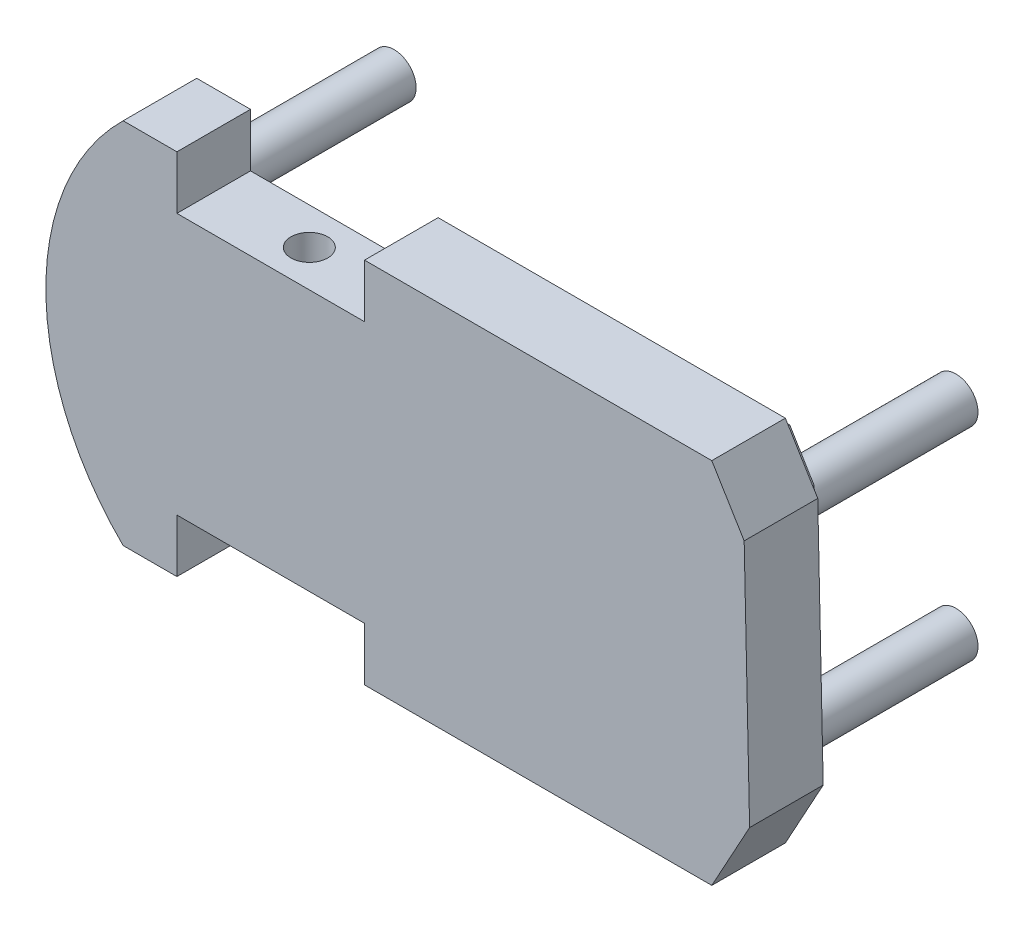
ISO-10303-21;
HEADER;
FILE_DESCRIPTION(('STEP AP214'),'2;1');
FILE_NAME('part.step','',(''),(''),'','','');
FILE_SCHEMA(('AUTOMOTIVE_DESIGN { 1 0 10303 214 1 1 1 1 }'));
ENDSEC;
DATA;
#1=APPLICATION_CONTEXT('core data for automotive mechanical design processes');
#2=APPLICATION_PROTOCOL_DEFINITION('international standard','automotive_design',2000,#1);
#3=PRODUCT_CONTEXT('',#1,'mechanical');
#4=PRODUCT('Part','Part','',(#3));
#5=PRODUCT_RELATED_PRODUCT_CATEGORY('part','',(#4));
#6=PRODUCT_DEFINITION_FORMATION('','',#4);
#7=PRODUCT_DEFINITION_CONTEXT('part definition',#1,'design');
#8=PRODUCT_DEFINITION('design','',#6,#7);
#9=PRODUCT_DEFINITION_SHAPE('','',#8);
#10=(LENGTH_UNIT() NAMED_UNIT(*) SI_UNIT(.MILLI.,.METRE.));
#11=(NAMED_UNIT(*) PLANE_ANGLE_UNIT() SI_UNIT($,.RADIAN.));
#12=(NAMED_UNIT(*) SI_UNIT($,.STERADIAN.) SOLID_ANGLE_UNIT());
#13=UNCERTAINTY_MEASURE_WITH_UNIT(LENGTH_MEASURE(1.E-05),#10,'distance_accuracy_value','');
#14=(GEOMETRIC_REPRESENTATION_CONTEXT(3) GLOBAL_UNCERTAINTY_ASSIGNED_CONTEXT((#13)) GLOBAL_UNIT_ASSIGNED_CONTEXT((#10,
#11,#12)) REPRESENTATION_CONTEXT('',''));
#15=CARTESIAN_POINT('',(0.,0.,0.));
#16=DIRECTION('',(0.,0.,1.));
#17=DIRECTION('',(1.,0.,0.));
#18=AXIS2_PLACEMENT_3D('',#15,#16,#17);
#19=CARTESIAN_POINT('',(0.,0.,0.));
#20=DIRECTION('',(0.,0.,1.));
#21=DIRECTION('',(1.,0.,0.));
#22=AXIS2_PLACEMENT_3D('',#19,#20,#21);
#23=PLANE('',#22);
#24=DIRECTION('',(-1.,0.,0.));
#25=VECTOR('',#24,1.);
#26=CARTESIAN_POINT('',(-1221.0953514439,1.42875124120427,0.));
#27=LINE('',#26,#25);
#28=CARTESIAN_POINT('',(-1170.0953514439,1.42875124120427,0.));
#29=VERTEX_POINT('',#28);
#30=CARTESIAN_POINT('',(-1221.0953514439,1.42875124120427,0.));
#31=VERTEX_POINT('',#30);
#32=EDGE_CURVE('E284',#29,#31,#27,.T.);
#33=ORIENTED_EDGE('',*,*,#32,.T.);
#34=DIRECTION('',(0.,-1.,0.));
#35=VECTOR('',#34,1.);
#36=CARTESIAN_POINT('',(-1221.0953514439,-13.5712487587957,0.));
#37=LINE('',#36,#35);
#38=CARTESIAN_POINT('',(-1221.0953514439,-13.0712487587957,0.));
#39=VERTEX_POINT('',#38);
#40=EDGE_CURVE('E281',#31,#39,#37,.T.);
#41=ORIENTED_EDGE('',*,*,#40,.T.);
#42=DIRECTION('',(1.,0.,0.));
#43=VECTOR('',#42,1.);
#44=CARTESIAN_POINT('',(0.,-13.0712487587957,0.));
#45=LINE('',#44,#43);
#46=CARTESIAN_POINT('',(-1235.70737283867,-13.0712487587957,0.));
#47=VERTEX_POINT('',#46);
#48=EDGE_CURVE('E346',#47,#39,#45,.T.);
#49=ORIENTED_EDGE('',*,*,#48,.F.);
#50=CARTESIAN_POINT('',(-1186.717577983,36.9287512412043,0.));
#51=DIRECTION('',(0.,0.,1.));
#52=DIRECTION('',(1.,0.,0.));
#53=AXIS2_PLACEMENT_3D('',#50,#51,#52);
#54=CIRCLE('',#53,69.9999999999998);
#55=CARTESIAN_POINT('',(-1235.70737283867,86.9287512412043,0.));
#56=VERTEX_POINT('',#55);
#57=EDGE_CURVE('E362',#56,#47,#54,.T.);
#58=ORIENTED_EDGE('',*,*,#57,.F.);
#59=DIRECTION('',(1.,0.,0.));
#60=VECTOR('',#59,1.);
#61=CARTESIAN_POINT('',(0.,86.9287512412044,0.));
#62=LINE('',#61,#60);
#63=CARTESIAN_POINT('',(-1221.0953514439,86.9287512412043,0.));
#64=VERTEX_POINT('',#63);
#65=EDGE_CURVE('E359',#56,#64,#62,.T.);
#66=ORIENTED_EDGE('',*,*,#65,.T.);
#67=DIRECTION('',(0.,-1.,0.));
#68=VECTOR('',#67,1.);
#69=CARTESIAN_POINT('',(-1221.0953514439,0.,0.));
#70=LINE('',#69,#68);
#71=CARTESIAN_POINT('',(-1221.0953514439,72.4287512412043,0.));
#72=VERTEX_POINT('',#71);
#73=EDGE_CURVE('E50',#64,#72,#70,.T.);
#74=ORIENTED_EDGE('',*,*,#73,.T.);
#75=DIRECTION('',(1.,0.,0.));
#76=VECTOR('',#75,1.);
#77=CARTESIAN_POINT('',(-1221.0953514439,72.4287512412043,0.));
#78=LINE('',#77,#76);
#79=CARTESIAN_POINT('',(-1170.0953514439,72.4287512412043,0.));
#80=VERTEX_POINT('',#79);
#81=EDGE_CURVE('E280',#72,#80,#78,.T.);
#82=ORIENTED_EDGE('',*,*,#81,.T.);
#83=DIRECTION('',(0.,1.,0.));
#84=VECTOR('',#83,1.);
#85=CARTESIAN_POINT('',(-1170.0953514439,87.4287512412043,0.));
#86=LINE('',#85,#84);
#87=CARTESIAN_POINT('',(-1170.0953514439,86.9287512412043,0.));
#88=VERTEX_POINT('',#87);
#89=EDGE_CURVE('E295',#80,#88,#86,.T.);
#90=ORIENTED_EDGE('',*,*,#89,.T.);
#91=CARTESIAN_POINT('',(-1075.70737283867,86.9287512412043,0.));
#92=VERTEX_POINT('',#91);
#93=EDGE_CURVE('E358',#88,#92,#62,.T.);
#94=ORIENTED_EDGE('',*,*,#93,.T.);
#95=DIRECTION('',(0.519081832393097,-0.854724547020515,0.));
#96=VECTOR('',#95,1.);
#97=CARTESIAN_POINT('',(-747.294527683499,-453.838624524696,0.));
#98=LINE('',#97,#96);
#99=CARTESIAN_POINT('',(-1066.90354903965,72.4323003175205,0.));
#100=VERTEX_POINT('',#99);
#101=EDGE_CURVE('E355',#92,#100,#98,.T.);
#102=ORIENTED_EDGE('',*,*,#101,.T.);
#103=DIRECTION('',(0.0221757799851452,-0.999754087154462,0.));
#104=VECTOR('',#103,1.);
#105=CARTESIAN_POINT('',(-1064.77303522339,-23.6179805280267,0.));
#106=LINE('',#105,#104);
#107=CARTESIAN_POINT('',(-1065.42313354024,5.69050150754845,0.));
#108=VERTEX_POINT('',#107);
#109=EDGE_CURVE('E352',#100,#108,#106,.T.);
#110=ORIENTED_EDGE('',*,*,#109,.T.);
#111=DIRECTION('',(-0.480672254761375,-0.87690032700565,0.));
#112=VECTOR('',#111,1.);
#113=CARTESIAN_POINT('',(-821.660131553006,450.392383168271,0.));
#114=LINE('',#113,#112);
#115=CARTESIAN_POINT('',(-1075.70737283867,-13.0712487587957,0.));
#116=VERTEX_POINT('',#115);
#117=EDGE_CURVE('E349',#108,#116,#114,.T.);
#118=ORIENTED_EDGE('',*,*,#117,.T.);
#119=CARTESIAN_POINT('',(-1170.0953514439,-13.0712487587957,0.));
#120=VERTEX_POINT('',#119);
#121=EDGE_CURVE('E325',#120,#116,#45,.T.);
#122=ORIENTED_EDGE('',*,*,#121,.F.);
#123=DIRECTION('',(0.,1.,0.));
#124=VECTOR('',#123,1.);
#125=CARTESIAN_POINT('',(-1170.0953514439,0.,0.));
#126=LINE('',#125,#124);
#127=EDGE_CURVE('E11',#120,#29,#126,.T.);
#128=ORIENTED_EDGE('',*,*,#127,.T.);
#129=EDGE_LOOP('',(#33,#41,#49,#58,#66,#74,#82,#90,#94,#102,#110,#118,#122,#128));
#130=FACE_BOUND('',#129,.T.);
#131=DIRECTION('',(0.,1.,0.));
#132=VECTOR('',#131,1.);
#133=CARTESIAN_POINT('',(-1165.0953514439,-8.07124875879573,0.));
#134=LINE('',#133,#132);
#135=CARTESIAN_POINT('',(-1165.0953514439,-8.07124875879573,0.));
#136=VERTEX_POINT('',#135);
#137=CARTESIAN_POINT('',(-1165.0953514439,6.42875124120427,0.));
#138=VERTEX_POINT('',#137);
#139=EDGE_CURVE('E248',#136,#138,#134,.T.);
#140=ORIENTED_EDGE('',*,*,#139,.F.);
#141=DIRECTION('',(-1.,0.,0.));
#142=VECTOR('',#141,1.);
#143=CARTESIAN_POINT('',(-1078.66852890878,-8.07124875879573,0.));
#144=LINE('',#143,#142);
#145=CARTESIAN_POINT('',(-1078.66852890878,-8.07124875879573,0.));
#146=VERTEX_POINT('',#145);
#147=EDGE_CURVE('E245',#146,#136,#144,.T.);
#148=ORIENTED_EDGE('',*,*,#147,.F.);
#149=DIRECTION('',(-0.480672254761412,-0.87690032700563,0.));
#150=VECTOR('',#149,1.);
#151=CARTESIAN_POINT('',(-1070.45161388771,6.91903910903656,0.));
#152=LINE('',#151,#150);
#153=CARTESIAN_POINT('',(-1070.45161388771,6.91903910903657,0.));
#154=VERTEX_POINT('',#153);
#155=EDGE_CURVE('E871',#154,#146,#152,.T.);
#156=ORIENTED_EDGE('',*,*,#155,.F.);
#157=DIRECTION('',(0.0221757799851395,-0.999754087154462,0.));
#158=VECTOR('',#157,1.);
#159=CARTESIAN_POINT('',(-1071.87260956373,70.9820049161811,0.));
#160=LINE('',#159,#158);
#161=CARTESIAN_POINT('',(-1071.87260956373,70.9820049161811,0.));
#162=VERTEX_POINT('',#161);
#163=EDGE_CURVE('E874',#162,#154,#160,.T.);
#164=ORIENTED_EDGE('',*,*,#163,.F.);
#165=DIRECTION('',(0.519081832393101,-0.854724547020513,0.));
#166=VECTOR('',#165,1.);
#167=CARTESIAN_POINT('',(-1078.52066613464,81.9287512412043,0.));
#168=LINE('',#167,#166);
#169=CARTESIAN_POINT('',(-1078.52066613464,81.9287512412043,0.));
#170=VERTEX_POINT('',#169);
#171=EDGE_CURVE('E877',#170,#162,#168,.T.);
#172=ORIENTED_EDGE('',*,*,#171,.F.);
#173=DIRECTION('',(1.,0.,0.));
#174=VECTOR('',#173,1.);
#175=CARTESIAN_POINT('',(-1165.0953514439,81.9287512412043,0.));
#176=LINE('',#175,#174);
#177=CARTESIAN_POINT('',(-1165.0953514439,81.9287512412043,0.));
#178=VERTEX_POINT('',#177);
#179=EDGE_CURVE('E880',#178,#170,#176,.T.);
#180=ORIENTED_EDGE('',*,*,#179,.F.);
#181=DIRECTION('',(0.,1.,0.));
#182=VECTOR('',#181,1.);
#183=CARTESIAN_POINT('',(-1165.0953514439,67.4287512412043,0.));
#184=LINE('',#183,#182);
#185=CARTESIAN_POINT('',(-1165.0953514439,67.4287512412043,0.));
#186=VERTEX_POINT('',#185);
#187=EDGE_CURVE('E883',#186,#178,#184,.T.);
#188=ORIENTED_EDGE('',*,*,#187,.F.);
#189=DIRECTION('',(1.,0.,0.));
#190=VECTOR('',#189,1.);
#191=CARTESIAN_POINT('',(-1226.0953514439,67.4287512412043,0.));
#192=LINE('',#191,#190);
#193=CARTESIAN_POINT('',(-1226.0953514439,67.4287512412043,0.));
#194=VERTEX_POINT('',#193);
#195=EDGE_CURVE('E886',#194,#186,#192,.T.);
#196=ORIENTED_EDGE('',*,*,#195,.F.);
#197=DIRECTION('',(0.,-1.,0.));
#198=VECTOR('',#197,1.);
#199=CARTESIAN_POINT('',(-1226.0953514439,81.9287512412043,0.));
#200=LINE('',#199,#198);
#201=CARTESIAN_POINT('',(-1226.0953514439,81.9287512412043,0.));
#202=VERTEX_POINT('',#201);
#203=EDGE_CURVE('E889',#202,#194,#200,.T.);
#204=ORIENTED_EDGE('',*,*,#203,.F.);
#205=DIRECTION('',(1.,0.,0.));
#206=VECTOR('',#205,1.);
#207=CARTESIAN_POINT('',(-1233.62173558124,81.9287512412043,0.));
#208=LINE('',#207,#206);
#209=CARTESIAN_POINT('',(-1233.62173558124,81.9287512412043,0.));
#210=VERTEX_POINT('',#209);
#211=EDGE_CURVE('E892',#210,#202,#208,.T.);
#212=ORIENTED_EDGE('',*,*,#211,.F.);
#213=CARTESIAN_POINT('',(-1186.717577983,36.9287512412043,0.));
#214=DIRECTION('',(0.,0.,-1.));
#215=DIRECTION('',(-1.,0.,0.));
#216=AXIS2_PLACEMENT_3D('',#213,#214,#215);
#217=CIRCLE('',#216,64.9999999999998);
#218=CARTESIAN_POINT('',(-1233.62173558124,-8.07124875879572,0.));
#219=VERTEX_POINT('',#218);
#220=EDGE_CURVE('E895',#219,#210,#217,.T.);
#221=ORIENTED_EDGE('',*,*,#220,.F.);
#222=DIRECTION('',(-1.,0.,0.));
#223=VECTOR('',#222,1.);
#224=CARTESIAN_POINT('',(-1226.0953514439,-8.07124875879573,0.));
#225=LINE('',#224,#223);
#226=CARTESIAN_POINT('',(-1226.0953514439,-8.07124875879573,0.));
#227=VERTEX_POINT('',#226);
#228=EDGE_CURVE('E831',#227,#219,#225,.T.);
#229=ORIENTED_EDGE('',*,*,#228,.F.);
#230=DIRECTION('',(0.,-1.,0.));
#231=VECTOR('',#230,1.);
#232=CARTESIAN_POINT('',(-1226.0953514439,6.42875124120427,0.));
#233=LINE('',#232,#231);
#234=CARTESIAN_POINT('',(-1226.0953514439,6.42875124120427,0.));
#235=VERTEX_POINT('',#234);
#236=EDGE_CURVE('E63',#235,#227,#233,.T.);
#237=ORIENTED_EDGE('',*,*,#236,.F.);
#238=DIRECTION('',(-1.,0.,0.));
#239=VECTOR('',#238,1.);
#240=CARTESIAN_POINT('',(-1165.0953514439,6.42875124120427,0.));
#241=LINE('',#240,#239);
#242=EDGE_CURVE('E58',#138,#235,#241,.T.);
#243=ORIENTED_EDGE('',*,*,#242,.F.);
#244=EDGE_LOOP('',(#140,#148,#156,#164,#172,#180,#188,#196,#204,#212,#221,#229,#237,#243));
#245=FACE_BOUND('',#244,.T.);
#246=ADVANCED_FACE('F41',(#130,#245),#23,.F.);
#247=CARTESIAN_POINT('',(0.,-13.0712487587957,20.));
#248=DIRECTION('',(0.,1.,0.));
#249=DIRECTION('',(0.,0.,1.));
#250=AXIS2_PLACEMENT_3D('',#247,#248,#249);
#251=PLANE('',#250);
#252=DIRECTION('',(0.,0.,1.));
#253=VECTOR('',#252,1.);
#254=CARTESIAN_POINT('',(-1221.0953514439,-13.0712487587957,20.));
#255=LINE('',#254,#253);
#256=CARTESIAN_POINT('',(-1221.0953514439,-13.0712487587957,20.));
#257=VERTEX_POINT('',#256);
#258=EDGE_CURVE('E323',#39,#257,#255,.T.);
#259=ORIENTED_EDGE('',*,*,#258,.T.);
#260=DIRECTION('',(1.,0.,0.));
#261=VECTOR('',#260,1.);
#262=CARTESIAN_POINT('',(0.,-13.0712487587957,20.));
#263=LINE('',#262,#261);
#264=CARTESIAN_POINT('',(-1235.70737283867,-13.0712487587957,20.));
#265=VERTEX_POINT('',#264);
#266=EDGE_CURVE('E326',#265,#257,#263,.T.);
#267=ORIENTED_EDGE('',*,*,#266,.F.);
#268=DIRECTION('',(0.,0.,-1.));
#269=VECTOR('',#268,1.);
#270=CARTESIAN_POINT('',(-1235.70737283867,-13.0712487587957,20.));
#271=LINE('',#270,#269);
#272=EDGE_CURVE('E345',#265,#47,#271,.T.);
#273=ORIENTED_EDGE('',*,*,#272,.T.);
#274=ORIENTED_EDGE('',*,*,#48,.T.);
#275=EDGE_LOOP('',(#259,#267,#273,#274));
#276=FACE_BOUND('',#275,.T.);
#277=ADVANCED_FACE('F397',(#276),#251,.F.);
#278=CARTESIAN_POINT('',(0.,86.9287512412044,20.));
#279=DIRECTION('',(0.,1.,0.));
#280=DIRECTION('',(-1.,0.,0.));
#281=AXIS2_PLACEMENT_3D('',#278,#279,#280);
#282=PLANE('',#281);
#283=ORIENTED_EDGE('',*,*,#65,.F.);
#284=DIRECTION('',(0.,0.,-1.));
#285=VECTOR('',#284,1.);
#286=CARTESIAN_POINT('',(-1235.70737283867,86.9287512412043,20.));
#287=LINE('',#286,#285);
#288=CARTESIAN_POINT('',(-1235.70737283867,86.9287512412043,20.));
#289=VERTEX_POINT('',#288);
#290=EDGE_CURVE('E366',#289,#56,#287,.T.);
#291=ORIENTED_EDGE('',*,*,#290,.F.);
#292=DIRECTION('',(1.,0.,0.));
#293=VECTOR('',#292,1.);
#294=CARTESIAN_POINT('',(0.,86.9287512412044,20.));
#295=LINE('',#294,#293);
#296=CARTESIAN_POINT('',(-1221.0953514439,86.9287512412043,20.));
#297=VERTEX_POINT('',#296);
#298=EDGE_CURVE('E340',#289,#297,#295,.T.);
#299=ORIENTED_EDGE('',*,*,#298,.T.);
#300=DIRECTION('',(0.,0.,1.));
#301=VECTOR('',#300,1.);
#302=CARTESIAN_POINT('',(-1221.0953514439,86.9287512412043,20.));
#303=LINE('',#302,#301);
#304=EDGE_CURVE('E310',#64,#297,#303,.T.);
#305=ORIENTED_EDGE('',*,*,#304,.F.);
#306=EDGE_LOOP('',(#283,#291,#299,#305));
#307=FACE_BOUND('',#306,.T.);
#308=ADVANCED_FACE('F403',(#307),#282,.T.);
#309=ORIENTED_EDGE('',*,*,#121,.T.);
#310=DIRECTION('',(0.,0.,-1.));
#311=VECTOR('',#310,1.);
#312=CARTESIAN_POINT('',(-1075.70737283867,-13.0712487587957,20.));
#313=LINE('',#312,#311);
#314=CARTESIAN_POINT('',(-1075.70737283867,-13.0712487587957,20.));
#315=VERTEX_POINT('',#314);
#316=EDGE_CURVE('E374',#315,#116,#313,.T.);
#317=ORIENTED_EDGE('',*,*,#316,.F.);
#318=CARTESIAN_POINT('',(-1170.0953514439,-13.0712487587957,20.));
#319=VERTEX_POINT('',#318);
#320=EDGE_CURVE('E330',#319,#315,#263,.T.);
#321=ORIENTED_EDGE('',*,*,#320,.F.);
#322=DIRECTION('',(0.,0.,-1.));
#323=VECTOR('',#322,1.);
#324=CARTESIAN_POINT('',(-1170.0953514439,-13.0712487587957,20.));
#325=LINE('',#324,#323);
#326=EDGE_CURVE('E315',#319,#120,#325,.T.);
#327=ORIENTED_EDGE('',*,*,#326,.T.);
#328=EDGE_LOOP('',(#309,#317,#321,#327));
#329=FACE_BOUND('',#328,.T.);
#330=ADVANCED_FACE('F43',(#329),#251,.F.);
#331=CARTESIAN_POINT('',(-821.660131553006,450.392383168271,20.));
#332=DIRECTION('',(0.87690032700565,-0.480672254761375,0.));
#333=DIRECTION('',(0.480672254761375,0.87690032700565,0.));
#334=AXIS2_PLACEMENT_3D('',#331,#332,#333);
#335=PLANE('',#334);
#336=ORIENTED_EDGE('',*,*,#117,.F.);
#337=DIRECTION('',(0.,0.,-1.));
#338=VECTOR('',#337,1.);
#339=CARTESIAN_POINT('',(-1065.42313354024,5.69050150754845,20.));
#340=LINE('',#339,#338);
#341=CARTESIAN_POINT('',(-1065.42313354024,5.69050150754845,20.));
#342=VERTEX_POINT('',#341);
#343=EDGE_CURVE('E372',#342,#108,#340,.T.);
#344=ORIENTED_EDGE('',*,*,#343,.F.);
#345=DIRECTION('',(-0.480672254761375,-0.87690032700565,0.));
#346=VECTOR('',#345,1.);
#347=CARTESIAN_POINT('',(-821.660131553006,450.392383168271,20.));
#348=LINE('',#347,#346);
#349=EDGE_CURVE('E329',#342,#315,#348,.T.);
#350=ORIENTED_EDGE('',*,*,#349,.T.);
#351=ORIENTED_EDGE('',*,*,#316,.T.);
#352=EDGE_LOOP('',(#336,#344,#350,#351));
#353=FACE_BOUND('',#352,.T.);
#354=ADVANCED_FACE('F423',(#353),#335,.T.);
#355=CARTESIAN_POINT('',(-1064.77303522339,-23.6179805280267,20.));
#356=DIRECTION('',(0.999754087154461,0.0221757799851452,0.));
#357=DIRECTION('',(-0.0221757799851452,0.999754087154462,0.));
#358=AXIS2_PLACEMENT_3D('',#355,#356,#357);
#359=PLANE('',#358);
#360=ORIENTED_EDGE('',*,*,#109,.F.);
#361=DIRECTION('',(0.,0.,-1.));
#362=VECTOR('',#361,1.);
#363=CARTESIAN_POINT('',(-1066.90354903965,72.4323003175205,20.));
#364=LINE('',#363,#362);
#365=CARTESIAN_POINT('',(-1066.90354903965,72.4323003175205,20.));
#366=VERTEX_POINT('',#365);
#367=EDGE_CURVE('E370',#366,#100,#364,.T.);
#368=ORIENTED_EDGE('',*,*,#367,.F.);
#369=DIRECTION('',(0.0221757799851452,-0.999754087154462,0.));
#370=VECTOR('',#369,1.);
#371=CARTESIAN_POINT('',(-1064.77303522339,-23.6179805280267,20.));
#372=LINE('',#371,#370);
#373=EDGE_CURVE('E333',#366,#342,#372,.T.);
#374=ORIENTED_EDGE('',*,*,#373,.T.);
#375=ORIENTED_EDGE('',*,*,#343,.T.);
#376=EDGE_LOOP('',(#360,#368,#374,#375));
#377=FACE_BOUND('',#376,.T.);
#378=ADVANCED_FACE('F420',(#377),#359,.T.);
#379=CARTESIAN_POINT('',(-747.294527683499,-453.838624524696,20.));
#380=DIRECTION('',(0.854724547020515,0.519081832393097,0.));
#381=DIRECTION('',(-0.519081832393097,0.854724547020515,0.));
#382=AXIS2_PLACEMENT_3D('',#379,#380,#381);
#383=PLANE('',#382);
#384=ORIENTED_EDGE('',*,*,#101,.F.);
#385=DIRECTION('',(0.,0.,-1.));
#386=VECTOR('',#385,1.);
#387=CARTESIAN_POINT('',(-1075.70737283867,86.9287512412043,20.));
#388=LINE('',#387,#386);
#389=CARTESIAN_POINT('',(-1075.70737283867,86.9287512412043,20.));
#390=VERTEX_POINT('',#389);
#391=EDGE_CURVE('E368',#390,#92,#388,.T.);
#392=ORIENTED_EDGE('',*,*,#391,.F.);
#393=DIRECTION('',(0.519081832393097,-0.854724547020515,0.));
#394=VECTOR('',#393,1.);
#395=CARTESIAN_POINT('',(-747.294527683499,-453.838624524696,20.));
#396=LINE('',#395,#394);
#397=EDGE_CURVE('E336',#390,#366,#396,.T.);
#398=ORIENTED_EDGE('',*,*,#397,.T.);
#399=ORIENTED_EDGE('',*,*,#367,.T.);
#400=EDGE_LOOP('',(#384,#392,#398,#399));
#401=FACE_BOUND('',#400,.T.);
#402=ADVANCED_FACE('F416',(#401),#383,.T.);
#403=ORIENTED_EDGE('',*,*,#93,.F.);
#404=DIRECTION('',(0.,0.,-1.));
#405=VECTOR('',#404,1.);
#406=CARTESIAN_POINT('',(-1170.0953514439,86.9287512412043,20.));
#407=LINE('',#406,#405);
#408=CARTESIAN_POINT('',(-1170.0953514439,86.9287512412043,20.));
#409=VERTEX_POINT('',#408);
#410=EDGE_CURVE('E305',#409,#88,#407,.T.);
#411=ORIENTED_EDGE('',*,*,#410,.F.);
#412=EDGE_CURVE('E339',#409,#390,#295,.T.);
#413=ORIENTED_EDGE('',*,*,#412,.T.);
#414=ORIENTED_EDGE('',*,*,#391,.T.);
#415=EDGE_LOOP('',(#403,#411,#413,#414));
#416=FACE_BOUND('',#415,.T.);
#417=ADVANCED_FACE('F412',(#416),#282,.T.);
#418=CARTESIAN_POINT('',(-1186.717577983,36.9287512412043,20.));
#419=DIRECTION('',(0.,0.,-1.));
#420=DIRECTION('',(-1.,0.,0.));
#421=AXIS2_PLACEMENT_3D('',#418,#419,#420);
#422=CYLINDRICAL_SURFACE('',#421,69.9999999999998);
#423=ORIENTED_EDGE('',*,*,#57,.T.);
#424=ORIENTED_EDGE('',*,*,#272,.F.);
#425=CARTESIAN_POINT('',(-1186.717577983,36.9287512412043,20.));
#426=DIRECTION('',(0.,0.,1.));
#427=DIRECTION('',(1.,0.,0.));
#428=AXIS2_PLACEMENT_3D('',#425,#426,#427);
#429=CIRCLE('',#428,69.9999999999998);
#430=EDGE_CURVE('E343',#289,#265,#429,.T.);
#431=ORIENTED_EDGE('',*,*,#430,.F.);
#432=ORIENTED_EDGE('',*,*,#290,.T.);
#433=EDGE_LOOP('',(#423,#424,#431,#432));
#434=FACE_BOUND('',#433,.T.);
#435=ADVANCED_FACE('F409',(#434),#422,.T.);
#436=CARTESIAN_POINT('',(0.,0.,20.));
#437=DIRECTION('',(0.,0.,1.));
#438=DIRECTION('',(1.,0.,0.));
#439=AXIS2_PLACEMENT_3D('',#436,#437,#438);
#440=PLANE('',#439);
#441=DIRECTION('',(0.,-1.,0.));
#442=VECTOR('',#441,1.);
#443=CARTESIAN_POINT('',(-1221.0953514439,0.,20.));
#444=LINE('',#443,#442);
#445=CARTESIAN_POINT('',(-1221.0953514439,1.42875124120427,20.));
#446=VERTEX_POINT('',#445);
#447=EDGE_CURVE('E320',#446,#257,#444,.T.);
#448=ORIENTED_EDGE('',*,*,#447,.F.);
#449=DIRECTION('',(-1.,0.,0.));
#450=VECTOR('',#449,1.);
#451=CARTESIAN_POINT('',(0.,1.42875124120427,20.));
#452=LINE('',#451,#450);
#453=CARTESIAN_POINT('',(-1170.0953514439,1.42875124120427,20.));
#454=VERTEX_POINT('',#453);
#455=EDGE_CURVE('E317',#454,#446,#452,.T.);
#456=ORIENTED_EDGE('',*,*,#455,.F.);
#457=DIRECTION('',(0.,1.,0.));
#458=VECTOR('',#457,1.);
#459=CARTESIAN_POINT('',(-1170.0953514439,0.,20.));
#460=LINE('',#459,#458);
#461=EDGE_CURVE('E312',#319,#454,#460,.T.);
#462=ORIENTED_EDGE('',*,*,#461,.F.);
#463=ORIENTED_EDGE('',*,*,#320,.T.);
#464=ORIENTED_EDGE('',*,*,#349,.F.);
#465=ORIENTED_EDGE('',*,*,#373,.F.);
#466=ORIENTED_EDGE('',*,*,#397,.F.);
#467=ORIENTED_EDGE('',*,*,#412,.F.);
#468=DIRECTION('',(0.,1.,0.));
#469=VECTOR('',#468,1.);
#470=CARTESIAN_POINT('',(-1170.0953514439,0.,20.));
#471=LINE('',#470,#469);
#472=CARTESIAN_POINT('',(-1170.0953514439,72.4287512412043,20.));
#473=VERTEX_POINT('',#472);
#474=EDGE_CURVE('E303',#473,#409,#471,.T.);
#475=ORIENTED_EDGE('',*,*,#474,.F.);
#476=DIRECTION('',(1.,0.,0.));
#477=VECTOR('',#476,1.);
#478=CARTESIAN_POINT('',(0.,72.4287512412043,20.));
#479=LINE('',#478,#477);
#480=CARTESIAN_POINT('',(-1221.0953514439,72.4287512412043,20.));
#481=VERTEX_POINT('',#480);
#482=EDGE_CURVE('E291',#481,#473,#479,.T.);
#483=ORIENTED_EDGE('',*,*,#482,.F.);
#484=DIRECTION('',(0.,-1.,0.));
#485=VECTOR('',#484,1.);
#486=CARTESIAN_POINT('',(-1221.0953514439,0.,20.));
#487=LINE('',#486,#485);
#488=EDGE_CURVE('E307',#297,#481,#487,.T.);
#489=ORIENTED_EDGE('',*,*,#488,.F.);
#490=ORIENTED_EDGE('',*,*,#298,.F.);
#491=ORIENTED_EDGE('',*,*,#430,.T.);
#492=ORIENTED_EDGE('',*,*,#266,.T.);
#493=EDGE_LOOP('',(#448,#456,#462,#463,#464,#465,#466,#467,#475,#483,#489,#490,#491,#492));
#494=FACE_BOUND('',#493,.T.);
#495=ADVANCED_FACE('F407',(#494),#440,.T.);
#496=CARTESIAN_POINT('',(-1221.0953514439,87.4287512412043,0.));
#497=DIRECTION('',(-1.,0.,0.));
#498=DIRECTION('',(0.,0.,1.));
#499=AXIS2_PLACEMENT_3D('',#496,#497,#498);
#500=PLANE('',#499);
#501=ORIENTED_EDGE('',*,*,#304,.T.);
#502=ORIENTED_EDGE('',*,*,#488,.T.);
#503=DIRECTION('',(0.,0.,1.));
#504=VECTOR('',#503,1.);
#505=CARTESIAN_POINT('',(-1221.0953514439,72.4287512412043,0.));
#506=LINE('',#505,#504);
#507=EDGE_CURVE('E298',#72,#481,#506,.T.);
#508=ORIENTED_EDGE('',*,*,#507,.F.);
#509=ORIENTED_EDGE('',*,*,#73,.F.);
#510=EDGE_LOOP('',(#501,#502,#508,#509));
#511=FACE_BOUND('',#510,.T.);
#512=ADVANCED_FACE('F485',(#511),#500,.F.);
#513=CARTESIAN_POINT('',(-1170.0953514439,87.4287512412043,0.));
#514=DIRECTION('',(1.,0.,0.));
#515=DIRECTION('',(0.,0.,-1.));
#516=AXIS2_PLACEMENT_3D('',#513,#514,#515);
#517=PLANE('',#516);
#518=DIRECTION('',(0.,0.,1.));
#519=VECTOR('',#518,1.);
#520=CARTESIAN_POINT('',(-1170.0953514439,72.4287512412043,0.));
#521=LINE('',#520,#519);
#522=EDGE_CURVE('E285',#80,#473,#521,.T.);
#523=ORIENTED_EDGE('',*,*,#522,.T.);
#524=ORIENTED_EDGE('',*,*,#474,.T.);
#525=ORIENTED_EDGE('',*,*,#410,.T.);
#526=ORIENTED_EDGE('',*,*,#89,.F.);
#527=EDGE_LOOP('',(#523,#524,#525,#526));
#528=FACE_BOUND('',#527,.T.);
#529=ADVANCED_FACE('F450',(#528),#517,.F.);
#530=CARTESIAN_POINT('',(-1221.0953514439,72.4287512412043,0.));
#531=DIRECTION('',(0.,-1.,0.));
#532=DIRECTION('',(0.,0.,-1.));
#533=AXIS2_PLACEMENT_3D('',#530,#531,#532);
#534=PLANE('',#533);
#535=CARTESIAN_POINT('',(-1195.0953514439,72.4287512412043,10.));
#536=DIRECTION('',(0.,-1.,0.));
#537=DIRECTION('',(0.,0.,-1.));
#538=AXIS2_PLACEMENT_3D('',#535,#536,#537);
#539=CIRCLE('',#538,4.99999999999982);
#540=CARTESIAN_POINT('',(-1195.0953514439,72.4287512412043,5.00000000000017));
#541=VERTEX_POINT('',#540);
#542=EDGE_CURVE('E265',#541,#541,#539,.T.);
#543=ORIENTED_EDGE('',*,*,#542,.T.);
#544=EDGE_LOOP('',(#543));
#545=FACE_BOUND('',#544,.T.);
#546=ORIENTED_EDGE('',*,*,#507,.T.);
#547=ORIENTED_EDGE('',*,*,#482,.T.);
#548=ORIENTED_EDGE('',*,*,#522,.F.);
#549=ORIENTED_EDGE('',*,*,#81,.F.);
#550=EDGE_LOOP('',(#546,#547,#548,#549));
#551=FACE_BOUND('',#550,.T.);
#552=ADVANCED_FACE('F452',(#545,#551),#534,.F.);
#553=CARTESIAN_POINT('',(-1221.0953514439,-13.5712487587957,0.));
#554=DIRECTION('',(-1.,0.,0.));
#555=DIRECTION('',(0.,0.,1.));
#556=AXIS2_PLACEMENT_3D('',#553,#554,#555);
#557=PLANE('',#556);
#558=DIRECTION('',(0.,0.,1.));
#559=VECTOR('',#558,1.);
#560=CARTESIAN_POINT('',(-1221.0953514439,1.42875124120427,0.));
#561=LINE('',#560,#559);
#562=EDGE_CURVE('E289',#31,#446,#561,.T.);
#563=ORIENTED_EDGE('',*,*,#562,.T.);
#564=ORIENTED_EDGE('',*,*,#447,.T.);
#565=ORIENTED_EDGE('',*,*,#258,.F.);
#566=ORIENTED_EDGE('',*,*,#40,.F.);
#567=EDGE_LOOP('',(#563,#564,#565,#566));
#568=FACE_BOUND('',#567,.T.);
#569=ADVANCED_FACE('F469',(#568),#557,.F.);
#570=CARTESIAN_POINT('',(-1170.0953514439,-13.5712487587957,0.));
#571=DIRECTION('',(1.,0.,0.));
#572=DIRECTION('',(0.,0.,-1.));
#573=AXIS2_PLACEMENT_3D('',#570,#571,#572);
#574=PLANE('',#573);
#575=ORIENTED_EDGE('',*,*,#127,.F.);
#576=ORIENTED_EDGE('',*,*,#326,.F.);
#577=ORIENTED_EDGE('',*,*,#461,.T.);
#578=DIRECTION('',(0.,0.,1.));
#579=VECTOR('',#578,1.);
#580=CARTESIAN_POINT('',(-1170.0953514439,1.42875124120427,0.));
#581=LINE('',#580,#579);
#582=EDGE_CURVE('E288',#29,#454,#581,.T.);
#583=ORIENTED_EDGE('',*,*,#582,.F.);
#584=EDGE_LOOP('',(#575,#576,#577,#583));
#585=FACE_BOUND('',#584,.T.);
#586=ADVANCED_FACE('F392',(#585),#574,.F.);
#587=CARTESIAN_POINT('',(-1221.0953514439,1.42875124120427,0.));
#588=DIRECTION('',(0.,1.,0.));
#589=DIRECTION('',(0.,0.,1.));
#590=AXIS2_PLACEMENT_3D('',#587,#588,#589);
#591=PLANE('',#590);
#592=CARTESIAN_POINT('',(-1195.0953514439,1.42875124120427,10.));
#593=DIRECTION('',(0.,1.,0.));
#594=DIRECTION('',(0.,0.,1.));
#595=AXIS2_PLACEMENT_3D('',#592,#593,#594);
#596=CIRCLE('',#595,4.99999999999982);
#597=CARTESIAN_POINT('',(-1195.0953514439,1.42875124120427,14.9999999999998));
#598=VERTEX_POINT('',#597);
#599=EDGE_CURVE('E264',#598,#598,#596,.T.);
#600=ORIENTED_EDGE('',*,*,#599,.T.);
#601=EDGE_LOOP('',(#600));
#602=FACE_BOUND('',#601,.T.);
#603=ORIENTED_EDGE('',*,*,#582,.T.);
#604=ORIENTED_EDGE('',*,*,#455,.T.);
#605=ORIENTED_EDGE('',*,*,#562,.F.);
#606=ORIENTED_EDGE('',*,*,#32,.F.);
#607=EDGE_LOOP('',(#603,#604,#605,#606));
#608=FACE_BOUND('',#607,.T.);
#609=ADVANCED_FACE('F380',(#602,#608),#591,.F.);
#610=CARTESIAN_POINT('',(-1195.0953514439,86.9287512412043,10.));
#611=DIRECTION('',(0.,-1.,0.));
#612=DIRECTION('',(0.,0.,-1.));
#613=AXIS2_PLACEMENT_3D('',#610,#611,#612);
#614=CYLINDRICAL_SURFACE('',#613,4.99999999999982);
#615=ORIENTED_EDGE('',*,*,#542,.F.);
#616=EDGE_LOOP('',(#615));
#617=FACE_BOUND('',#616,.T.);
#618=ORIENTED_EDGE('',*,*,#599,.F.);
#619=EDGE_LOOP('',(#618));
#620=FACE_BOUND('',#619,.T.);
#621=ADVANCED_FACE('F383',(#617,#620),#614,.F.);
#622=CARTESIAN_POINT('',(-1165.0953514439,-8.07124875879573,-4.));
#623=DIRECTION('',(1.,0.,0.));
#624=DIRECTION('',(0.,0.,-1.));
#625=AXIS2_PLACEMENT_3D('',#622,#623,#624);
#626=PLANE('',#625);
#627=ORIENTED_EDGE('',*,*,#139,.T.);
#628=DIRECTION('',(0.,0.,1.));
#629=VECTOR('',#628,1.);
#630=CARTESIAN_POINT('',(-1165.0953514439,6.42875124120427,-4.));
#631=LINE('',#630,#629);
#632=CARTESIAN_POINT('',(-1165.0953514439,6.42875124120427,-4.));
#633=VERTEX_POINT('',#632);
#634=EDGE_CURVE('E229',#633,#138,#631,.T.);
#635=ORIENTED_EDGE('',*,*,#634,.F.);
#636=DIRECTION('',(0.,1.,0.));
#637=VECTOR('',#636,1.);
#638=CARTESIAN_POINT('',(-1165.0953514439,-8.07124875879573,-4.));
#639=LINE('',#638,#637);
#640=CARTESIAN_POINT('',(-1165.0953514439,-8.07124875879573,-4.));
#641=VERTEX_POINT('',#640);
#642=EDGE_CURVE('E236',#641,#633,#639,.T.);
#643=ORIENTED_EDGE('',*,*,#642,.F.);
#644=DIRECTION('',(0.,0.,1.));
#645=VECTOR('',#644,1.);
#646=CARTESIAN_POINT('',(-1165.0953514439,-8.07124875879573,-4.));
#647=LINE('',#646,#645);
#648=EDGE_CURVE('E867',#641,#136,#647,.T.);
#649=ORIENTED_EDGE('',*,*,#648,.T.);
#650=EDGE_LOOP('',(#627,#635,#643,#649));
#651=FACE_BOUND('',#650,.T.);
#652=ADVANCED_FACE('F247',(#651),#626,.F.);
#653=CARTESIAN_POINT('',(-1165.0953514439,6.42875124120427,-4.));
#654=DIRECTION('',(0.,1.,0.));
#655=DIRECTION('',(0.,0.,1.));
#656=AXIS2_PLACEMENT_3D('',#653,#654,#655);
#657=PLANE('',#656);
#658=ORIENTED_EDGE('',*,*,#242,.T.);
#659=DIRECTION('',(0.,0.,1.));
#660=VECTOR('',#659,1.);
#661=CARTESIAN_POINT('',(-1226.0953514439,6.42875124120427,-4.));
#662=LINE('',#661,#660);
#663=CARTESIAN_POINT('',(-1226.0953514439,6.42875124120427,-4.));
#664=VERTEX_POINT('',#663);
#665=EDGE_CURVE('E232',#664,#235,#662,.T.);
#666=ORIENTED_EDGE('',*,*,#665,.F.);
#667=DIRECTION('',(-1.,0.,0.));
#668=VECTOR('',#667,1.);
#669=CARTESIAN_POINT('',(-1165.0953514439,6.42875124120427,-4.));
#670=LINE('',#669,#668);
#671=EDGE_CURVE('E225',#633,#664,#670,.T.);
#672=ORIENTED_EDGE('',*,*,#671,.F.);
#673=ORIENTED_EDGE('',*,*,#634,.T.);
#674=EDGE_LOOP('',(#658,#666,#672,#673));
#675=FACE_BOUND('',#674,.T.);
#676=ADVANCED_FACE('F227',(#675),#657,.F.);
#677=CARTESIAN_POINT('',(-1226.0953514439,6.42875124120427,-4.));
#678=DIRECTION('',(-1.,0.,0.));
#679=DIRECTION('',(0.,0.,1.));
#680=AXIS2_PLACEMENT_3D('',#677,#678,#679);
#681=PLANE('',#680);
#682=ORIENTED_EDGE('',*,*,#236,.T.);
#683=DIRECTION('',(0.,0.,1.));
#684=VECTOR('',#683,1.);
#685=CARTESIAN_POINT('',(-1226.0953514439,-8.07124875879573,-4.));
#686=LINE('',#685,#684);
#687=CARTESIAN_POINT('',(-1226.0953514439,-8.07124875879573,-4.));
#688=VERTEX_POINT('',#687);
#689=EDGE_CURVE('E252',#688,#227,#686,.T.);
#690=ORIENTED_EDGE('',*,*,#689,.F.);
#691=DIRECTION('',(0.,-1.,0.));
#692=VECTOR('',#691,1.);
#693=CARTESIAN_POINT('',(-1226.0953514439,6.42875124120427,-4.));
#694=LINE('',#693,#692);
#695=EDGE_CURVE('E235',#664,#688,#694,.T.);
#696=ORIENTED_EDGE('',*,*,#695,.F.);
#697=ORIENTED_EDGE('',*,*,#665,.T.);
#698=EDGE_LOOP('',(#682,#690,#696,#697));
#699=FACE_BOUND('',#698,.T.);
#700=ADVANCED_FACE('F706',(#699),#681,.F.);
#701=CARTESIAN_POINT('',(-1226.0953514439,-8.07124875879573,-4.));
#702=DIRECTION('',(0.,1.,0.));
#703=DIRECTION('',(0.,0.,1.));
#704=AXIS2_PLACEMENT_3D('',#701,#702,#703);
#705=PLANE('',#704);
#706=ORIENTED_EDGE('',*,*,#228,.T.);
#707=DIRECTION('',(0.,0.,1.));
#708=VECTOR('',#707,1.);
#709=CARTESIAN_POINT('',(-1233.62173558124,-8.07124875879573,-4.));
#710=LINE('',#709,#708);
#711=CARTESIAN_POINT('',(-1233.62173558124,-8.07124875879573,-4.));
#712=VERTEX_POINT('',#711);
#713=EDGE_CURVE('E837',#712,#219,#710,.T.);
#714=ORIENTED_EDGE('',*,*,#713,.F.);
#715=DIRECTION('',(-1.,0.,0.));
#716=VECTOR('',#715,1.);
#717=CARTESIAN_POINT('',(-1226.0953514439,-8.07124875879573,-4.));
#718=LINE('',#717,#716);
#719=EDGE_CURVE('E836',#688,#712,#718,.T.);
#720=ORIENTED_EDGE('',*,*,#719,.F.);
#721=ORIENTED_EDGE('',*,*,#689,.T.);
#722=EDGE_LOOP('',(#706,#714,#720,#721));
#723=FACE_BOUND('',#722,.T.);
#724=ADVANCED_FACE('F696',(#723),#705,.F.);
#725=CARTESIAN_POINT('',(-1186.717577983,36.9287512412043,-4.));
#726=DIRECTION('',(0.,0.,1.));
#727=DIRECTION('',(1.,0.,0.));
#728=AXIS2_PLACEMENT_3D('',#725,#726,#727);
#729=CYLINDRICAL_SURFACE('',#728,64.9999999999998);
#730=ORIENTED_EDGE('',*,*,#220,.T.);
#731=DIRECTION('',(0.,0.,1.));
#732=VECTOR('',#731,1.);
#733=CARTESIAN_POINT('',(-1233.62173558124,81.9287512412043,-4.));
#734=LINE('',#733,#732);
#735=CARTESIAN_POINT('',(-1233.62173558124,81.9287512412043,-4.));
#736=VERTEX_POINT('',#735);
#737=EDGE_CURVE('E838',#736,#210,#734,.T.);
#738=ORIENTED_EDGE('',*,*,#737,.F.);
#739=CARTESIAN_POINT('',(-1186.717577983,36.9287512412043,-4.));
#740=DIRECTION('',(0.,0.,-1.));
#741=DIRECTION('',(-1.,0.,0.));
#742=AXIS2_PLACEMENT_3D('',#739,#740,#741);
#743=CIRCLE('',#742,64.9999999999998);
#744=EDGE_CURVE('E918',#712,#736,#743,.T.);
#745=ORIENTED_EDGE('',*,*,#744,.F.);
#746=ORIENTED_EDGE('',*,*,#713,.T.);
#747=EDGE_LOOP('',(#730,#738,#745,#746));
#748=FACE_BOUND('',#747,.T.);
#749=ADVANCED_FACE('F686',(#748),#729,.T.);
#750=CARTESIAN_POINT('',(-1233.62173558124,81.9287512412043,-4.));
#751=DIRECTION('',(0.,-1.,0.));
#752=DIRECTION('',(1.,0.,0.));
#753=AXIS2_PLACEMENT_3D('',#750,#751,#752);
#754=PLANE('',#753);
#755=ORIENTED_EDGE('',*,*,#211,.T.);
#756=DIRECTION('',(0.,0.,1.));
#757=VECTOR('',#756,1.);
#758=CARTESIAN_POINT('',(-1226.0953514439,81.9287512412043,-4.));
#759=LINE('',#758,#757);
#760=CARTESIAN_POINT('',(-1226.0953514439,81.9287512412043,-4.));
#761=VERTEX_POINT('',#760);
#762=EDGE_CURVE('E843',#761,#202,#759,.T.);
#763=ORIENTED_EDGE('',*,*,#762,.F.);
#764=DIRECTION('',(1.,0.,0.));
#765=VECTOR('',#764,1.);
#766=CARTESIAN_POINT('',(-1233.62173558124,81.9287512412043,-4.));
#767=LINE('',#766,#765);
#768=EDGE_CURVE('E916',#736,#761,#767,.T.);
#769=ORIENTED_EDGE('',*,*,#768,.F.);
#770=ORIENTED_EDGE('',*,*,#737,.T.);
#771=EDGE_LOOP('',(#755,#763,#769,#770));
#772=FACE_BOUND('',#771,.T.);
#773=ADVANCED_FACE('F676',(#772),#754,.F.);
#774=CARTESIAN_POINT('',(-1226.0953514439,81.9287512412043,-4.));
#775=DIRECTION('',(-1.,0.,0.));
#776=DIRECTION('',(0.,0.,1.));
#777=AXIS2_PLACEMENT_3D('',#774,#775,#776);
#778=PLANE('',#777);
#779=ORIENTED_EDGE('',*,*,#203,.T.);
#780=DIRECTION('',(0.,0.,1.));
#781=VECTOR('',#780,1.);
#782=CARTESIAN_POINT('',(-1226.0953514439,67.4287512412043,-4.));
#783=LINE('',#782,#781);
#784=CARTESIAN_POINT('',(-1226.0953514439,67.4287512412043,-4.));
#785=VERTEX_POINT('',#784);
#786=EDGE_CURVE('E846',#785,#194,#783,.T.);
#787=ORIENTED_EDGE('',*,*,#786,.F.);
#788=DIRECTION('',(0.,-1.,0.));
#789=VECTOR('',#788,1.);
#790=CARTESIAN_POINT('',(-1226.0953514439,81.9287512412043,-4.));
#791=LINE('',#790,#789);
#792=EDGE_CURVE('E914',#761,#785,#791,.T.);
#793=ORIENTED_EDGE('',*,*,#792,.F.);
#794=ORIENTED_EDGE('',*,*,#762,.T.);
#795=EDGE_LOOP('',(#779,#787,#793,#794));
#796=FACE_BOUND('',#795,.T.);
#797=ADVANCED_FACE('F666',(#796),#778,.F.);
#798=CARTESIAN_POINT('',(-1226.0953514439,67.4287512412043,-4.));
#799=DIRECTION('',(0.,-1.,0.));
#800=DIRECTION('',(0.,0.,-1.));
#801=AXIS2_PLACEMENT_3D('',#798,#799,#800);
#802=PLANE('',#801);
#803=ORIENTED_EDGE('',*,*,#195,.T.);
#804=DIRECTION('',(0.,0.,1.));
#805=VECTOR('',#804,1.);
#806=CARTESIAN_POINT('',(-1165.0953514439,67.4287512412043,-4.));
#807=LINE('',#806,#805);
#808=CARTESIAN_POINT('',(-1165.0953514439,67.4287512412043,-4.));
#809=VERTEX_POINT('',#808);
#810=EDGE_CURVE('E849',#809,#186,#807,.T.);
#811=ORIENTED_EDGE('',*,*,#810,.F.);
#812=DIRECTION('',(1.,0.,0.));
#813=VECTOR('',#812,1.);
#814=CARTESIAN_POINT('',(-1226.0953514439,67.4287512412043,-4.));
#815=LINE('',#814,#813);
#816=EDGE_CURVE('E912',#785,#809,#815,.T.);
#817=ORIENTED_EDGE('',*,*,#816,.F.);
#818=ORIENTED_EDGE('',*,*,#786,.T.);
#819=EDGE_LOOP('',(#803,#811,#817,#818));
#820=FACE_BOUND('',#819,.T.);
#821=ADVANCED_FACE('F656',(#820),#802,.F.);
#822=CARTESIAN_POINT('',(-1165.0953514439,67.4287512412043,-4.));
#823=DIRECTION('',(1.,0.,0.));
#824=DIRECTION('',(0.,0.,-1.));
#825=AXIS2_PLACEMENT_3D('',#822,#823,#824);
#826=PLANE('',#825);
#827=ORIENTED_EDGE('',*,*,#187,.T.);
#828=DIRECTION('',(0.,0.,1.));
#829=VECTOR('',#828,1.);
#830=CARTESIAN_POINT('',(-1165.0953514439,81.9287512412043,-4.));
#831=LINE('',#830,#829);
#832=CARTESIAN_POINT('',(-1165.0953514439,81.9287512412043,-4.));
#833=VERTEX_POINT('',#832);
#834=EDGE_CURVE('E852',#833,#178,#831,.T.);
#835=ORIENTED_EDGE('',*,*,#834,.F.);
#836=DIRECTION('',(0.,1.,0.));
#837=VECTOR('',#836,1.);
#838=CARTESIAN_POINT('',(-1165.0953514439,67.4287512412043,-4.));
#839=LINE('',#838,#837);
#840=EDGE_CURVE('E910',#809,#833,#839,.T.);
#841=ORIENTED_EDGE('',*,*,#840,.F.);
#842=ORIENTED_EDGE('',*,*,#810,.T.);
#843=EDGE_LOOP('',(#827,#835,#841,#842));
#844=FACE_BOUND('',#843,.T.);
#845=ADVANCED_FACE('F646',(#844),#826,.F.);
#846=CARTESIAN_POINT('',(-1165.0953514439,81.9287512412043,-4.));
#847=DIRECTION('',(0.,-1.,0.));
#848=DIRECTION('',(0.,0.,-1.));
#849=AXIS2_PLACEMENT_3D('',#846,#847,#848);
#850=PLANE('',#849);
#851=ORIENTED_EDGE('',*,*,#179,.T.);
#852=DIRECTION('',(0.,0.,1.));
#853=VECTOR('',#852,1.);
#854=CARTESIAN_POINT('',(-1078.52066613464,81.9287512412043,-4.));
#855=LINE('',#854,#853);
#856=CARTESIAN_POINT('',(-1078.52066613464,81.9287512412043,-4.));
#857=VERTEX_POINT('',#856);
#858=EDGE_CURVE('E855',#857,#170,#855,.T.);
#859=ORIENTED_EDGE('',*,*,#858,.F.);
#860=DIRECTION('',(1.,0.,0.));
#861=VECTOR('',#860,1.);
#862=CARTESIAN_POINT('',(-1165.0953514439,81.9287512412043,-4.));
#863=LINE('',#862,#861);
#864=EDGE_CURVE('E908',#833,#857,#863,.T.);
#865=ORIENTED_EDGE('',*,*,#864,.F.);
#866=ORIENTED_EDGE('',*,*,#834,.T.);
#867=EDGE_LOOP('',(#851,#859,#865,#866));
#868=FACE_BOUND('',#867,.T.);
#869=ADVANCED_FACE('F636',(#868),#850,.F.);
#870=CARTESIAN_POINT('',(-1078.52066613464,81.9287512412043,-4.));
#871=DIRECTION('',(-0.854724547020513,-0.519081832393101,0.));
#872=DIRECTION('',(0.519081832393101,-0.854724547020513,0.));
#873=AXIS2_PLACEMENT_3D('',#870,#871,#872);
#874=PLANE('',#873);
#875=ORIENTED_EDGE('',*,*,#171,.T.);
#876=DIRECTION('',(0.,0.,1.));
#877=VECTOR('',#876,1.);
#878=CARTESIAN_POINT('',(-1071.87260956373,70.9820049161811,-4.));
#879=LINE('',#878,#877);
#880=CARTESIAN_POINT('',(-1071.87260956373,70.9820049161811,-4.));
#881=VERTEX_POINT('',#880);
#882=EDGE_CURVE('E858',#881,#162,#879,.T.);
#883=ORIENTED_EDGE('',*,*,#882,.F.);
#884=DIRECTION('',(0.519081832393101,-0.854724547020513,0.));
#885=VECTOR('',#884,1.);
#886=CARTESIAN_POINT('',(-1078.52066613464,81.9287512412043,-4.));
#887=LINE('',#886,#885);
#888=EDGE_CURVE('E906',#857,#881,#887,.T.);
#889=ORIENTED_EDGE('',*,*,#888,.F.);
#890=ORIENTED_EDGE('',*,*,#858,.T.);
#891=EDGE_LOOP('',(#875,#883,#889,#890));
#892=FACE_BOUND('',#891,.T.);
#893=ADVANCED_FACE('F626',(#892),#874,.F.);
#894=CARTESIAN_POINT('',(-1071.87260956373,70.9820049161811,-4.));
#895=DIRECTION('',(-0.999754087154462,-0.0221757799851395,0.));
#896=DIRECTION('',(0.0221757799851395,-0.999754087154462,0.));
#897=AXIS2_PLACEMENT_3D('',#894,#895,#896);
#898=PLANE('',#897);
#899=ORIENTED_EDGE('',*,*,#163,.T.);
#900=DIRECTION('',(0.,0.,1.));
#901=VECTOR('',#900,1.);
#902=CARTESIAN_POINT('',(-1070.45161388771,6.91903910903656,-4.));
#903=LINE('',#902,#901);
#904=CARTESIAN_POINT('',(-1070.45161388771,6.91903910903656,-4.));
#905=VERTEX_POINT('',#904);
#906=EDGE_CURVE('E861',#905,#154,#903,.T.);
#907=ORIENTED_EDGE('',*,*,#906,.F.);
#908=DIRECTION('',(0.0221757799851395,-0.999754087154462,0.));
#909=VECTOR('',#908,1.);
#910=CARTESIAN_POINT('',(-1071.87260956373,70.9820049161811,-4.));
#911=LINE('',#910,#909);
#912=EDGE_CURVE('E904',#881,#905,#911,.T.);
#913=ORIENTED_EDGE('',*,*,#912,.F.);
#914=ORIENTED_EDGE('',*,*,#882,.T.);
#915=EDGE_LOOP('',(#899,#907,#913,#914));
#916=FACE_BOUND('',#915,.T.);
#917=ADVANCED_FACE('F616',(#916),#898,.F.);
#918=CARTESIAN_POINT('',(-1070.45161388771,6.91903910903656,-4.));
#919=DIRECTION('',(-0.87690032700563,0.480672254761412,0.));
#920=DIRECTION('',(-0.480672254761412,-0.87690032700563,0.));
#921=AXIS2_PLACEMENT_3D('',#918,#919,#920);
#922=PLANE('',#921);
#923=ORIENTED_EDGE('',*,*,#155,.T.);
#924=DIRECTION('',(0.,0.,1.));
#925=VECTOR('',#924,1.);
#926=CARTESIAN_POINT('',(-1078.66852890878,-8.07124875879573,-4.));
#927=LINE('',#926,#925);
#928=CARTESIAN_POINT('',(-1078.66852890878,-8.07124875879573,-4.));
#929=VERTEX_POINT('',#928);
#930=EDGE_CURVE('E864',#929,#146,#927,.T.);
#931=ORIENTED_EDGE('',*,*,#930,.F.);
#932=DIRECTION('',(-0.480672254761412,-0.87690032700563,0.));
#933=VECTOR('',#932,1.);
#934=CARTESIAN_POINT('',(-1070.45161388771,6.91903910903656,-4.));
#935=LINE('',#934,#933);
#936=EDGE_CURVE('E902',#905,#929,#935,.T.);
#937=ORIENTED_EDGE('',*,*,#936,.F.);
#938=ORIENTED_EDGE('',*,*,#906,.T.);
#939=EDGE_LOOP('',(#923,#931,#937,#938));
#940=FACE_BOUND('',#939,.T.);
#941=ADVANCED_FACE('F606',(#940),#922,.F.);
#942=CARTESIAN_POINT('',(-1078.66852890878,-8.07124875879573,-4.));
#943=DIRECTION('',(0.,1.,0.));
#944=DIRECTION('',(0.,0.,1.));
#945=AXIS2_PLACEMENT_3D('',#942,#943,#944);
#946=PLANE('',#945);
#947=ORIENTED_EDGE('',*,*,#147,.T.);
#948=ORIENTED_EDGE('',*,*,#648,.F.);
#949=DIRECTION('',(-1.,0.,0.));
#950=VECTOR('',#949,1.);
#951=CARTESIAN_POINT('',(-1078.66852890878,-8.07124875879573,-4.));
#952=LINE('',#951,#950);
#953=EDGE_CURVE('E241',#929,#641,#952,.T.);
#954=ORIENTED_EDGE('',*,*,#953,.F.);
#955=ORIENTED_EDGE('',*,*,#930,.T.);
#956=EDGE_LOOP('',(#947,#948,#954,#955));
#957=FACE_BOUND('',#956,.T.);
#958=ADVANCED_FACE('F596',(#957),#946,.F.);
#959=CARTESIAN_POINT('',(-1186.717577983,36.9287512412043,-4.));
#960=DIRECTION('',(0.,0.,-1.));
#961=DIRECTION('',(-1.,0.,0.));
#962=AXIS2_PLACEMENT_3D('',#959,#960,#961);
#963=PLANE('',#962);
#964=CARTESIAN_POINT('',(-1079.34491519797,64.5120074018315,-4.));
#965=DIRECTION('',(0.,0.,-1.));
#966=DIRECTION('',(-1.,0.,0.));
#967=AXIS2_PLACEMENT_3D('',#964,#965,#966);
#968=CIRCLE('',#967,6.0000000000001);
#969=CARTESIAN_POINT('',(-1085.34491519797,64.5120074018315,-4.));
#970=VERTEX_POINT('',#969);
#971=EDGE_CURVE('E261',#970,#970,#968,.T.);
#972=ORIENTED_EDGE('',*,*,#971,.F.);
#973=EDGE_LOOP('',(#972));
#974=FACE_BOUND('',#973,.T.);
#975=CARTESIAN_POINT('',(-1079.34491519797,9.34549508057708,-4.));
#976=DIRECTION('',(0.,0.,-1.));
#977=DIRECTION('',(-1.,0.,0.));
#978=AXIS2_PLACEMENT_3D('',#975,#976,#977);
#979=CIRCLE('',#978,6.0000000000001);
#980=CARTESIAN_POINT('',(-1085.34491519797,9.34549508057708,-4.));
#981=VERTEX_POINT('',#980);
#982=EDGE_CURVE('E258',#981,#981,#979,.T.);
#983=ORIENTED_EDGE('',*,*,#982,.F.);
#984=EDGE_LOOP('',(#983));
#985=FACE_BOUND('',#984,.T.);
#986=CARTESIAN_POINT('',(-1232.06983047936,9.34549508057708,-4.));
#987=DIRECTION('',(0.,0.,-1.));
#988=DIRECTION('',(-1.,0.,0.));
#989=AXIS2_PLACEMENT_3D('',#986,#987,#988);
#990=CIRCLE('',#989,6.0000000000001);
#991=CARTESIAN_POINT('',(-1238.06983047936,9.34549508057708,-4.));
#992=VERTEX_POINT('',#991);
#993=EDGE_CURVE('E251',#992,#992,#990,.T.);
#994=ORIENTED_EDGE('',*,*,#993,.F.);
#995=EDGE_LOOP('',(#994));
#996=FACE_BOUND('',#995,.T.);
#997=CARTESIAN_POINT('',(-1232.06983047936,64.5120074018315,-4.));
#998=DIRECTION('',(0.,0.,-1.));
#999=DIRECTION('',(-1.,0.,0.));
#1000=AXIS2_PLACEMENT_3D('',#997,#998,#999);
#1001=CIRCLE('',#1000,6.0000000000001);
#1002=CARTESIAN_POINT('',(-1238.06983047936,64.5120074018315,-4.));
#1003=VERTEX_POINT('',#1002);
#1004=EDGE_CURVE('E45',#1003,#1003,#1001,.T.);
#1005=ORIENTED_EDGE('',*,*,#1004,.F.);
#1006=EDGE_LOOP('',(#1005));
#1007=FACE_BOUND('',#1006,.T.);
#1008=ORIENTED_EDGE('',*,*,#642,.T.);
#1009=ORIENTED_EDGE('',*,*,#671,.T.);
#1010=ORIENTED_EDGE('',*,*,#695,.T.);
#1011=ORIENTED_EDGE('',*,*,#719,.T.);
#1012=ORIENTED_EDGE('',*,*,#744,.T.);
#1013=ORIENTED_EDGE('',*,*,#768,.T.);
#1014=ORIENTED_EDGE('',*,*,#792,.T.);
#1015=ORIENTED_EDGE('',*,*,#816,.T.);
#1016=ORIENTED_EDGE('',*,*,#840,.T.);
#1017=ORIENTED_EDGE('',*,*,#864,.T.);
#1018=ORIENTED_EDGE('',*,*,#888,.T.);
#1019=ORIENTED_EDGE('',*,*,#912,.T.);
#1020=ORIENTED_EDGE('',*,*,#936,.T.);
#1021=ORIENTED_EDGE('',*,*,#953,.T.);
#1022=EDGE_LOOP('',(#1008,#1009,#1010,#1011,#1012,#1013,#1014,#1015,#1016,#1017,#1018,#1019,
#1020,#1021));
#1023=FACE_BOUND('',#1022,.T.);
#1024=ADVANCED_FACE('F239',(#974,#985,#996,#1007,#1023),#963,.T.);
#1025=CARTESIAN_POINT('',(-1232.06983047936,9.34549508057708,-50.));
#1026=DIRECTION('',(0.,0.,-1.));
#1027=DIRECTION('',(-1.,0.,0.));
#1028=AXIS2_PLACEMENT_3D('',#1025,#1026,#1027);
#1029=PLANE('',#1028);
#1030=CARTESIAN_POINT('',(-1232.06983047936,9.34549508057708,-50.));
#1031=DIRECTION('',(0.,0.,-1.));
#1032=DIRECTION('',(-1.,0.,0.));
#1033=AXIS2_PLACEMENT_3D('',#1030,#1031,#1032);
#1034=CIRCLE('',#1033,6.0000000000001);
#1035=CARTESIAN_POINT('',(-1238.06983047936,9.34549508057708,-50.));
#1036=VERTEX_POINT('',#1035);
#1037=EDGE_CURVE('E271',#1036,#1036,#1034,.T.);
#1038=ORIENTED_EDGE('',*,*,#1037,.T.);
#1039=EDGE_LOOP('',(#1038));
#1040=FACE_BOUND('',#1039,.T.);
#1041=ADVANCED_FACE('F585',(#1040),#1029,.T.);
#1042=CARTESIAN_POINT('',(-1232.06983047936,9.34549508057708,-50.));
#1043=DIRECTION('',(0.,0.,1.));
#1044=DIRECTION('',(1.,0.,0.));
#1045=AXIS2_PLACEMENT_3D('',#1042,#1043,#1044);
#1046=CYLINDRICAL_SURFACE('',#1045,6.0000000000001);
#1047=ORIENTED_EDGE('',*,*,#993,.T.);
#1048=EDGE_LOOP('',(#1047));
#1049=FACE_BOUND('',#1048,.T.);
#1050=ORIENTED_EDGE('',*,*,#1037,.F.);
#1051=EDGE_LOOP('',(#1050));
#1052=FACE_BOUND('',#1051,.T.);
#1053=ADVANCED_FACE('F580',(#1049,#1052),#1046,.T.);
#1054=CARTESIAN_POINT('',(-1079.34491519797,9.34549508057708,-50.));
#1055=DIRECTION('',(0.,0.,1.));
#1056=DIRECTION('',(1.,0.,0.));
#1057=AXIS2_PLACEMENT_3D('',#1054,#1055,#1056);
#1058=PLANE('',#1057);
#1059=CARTESIAN_POINT('',(-1079.34491519797,9.34549508057708,-50.));
#1060=DIRECTION('',(0.,0.,-1.));
#1061=DIRECTION('',(1.,0.,0.));
#1062=AXIS2_PLACEMENT_3D('',#1059,#1060,#1061);
#1063=CIRCLE('',#1062,6.0000000000001);
#1064=CARTESIAN_POINT('',(-1073.34491519797,9.34549508057708,-50.));
#1065=VERTEX_POINT('',#1064);
#1066=EDGE_CURVE('E274',#1065,#1065,#1063,.T.);
#1067=ORIENTED_EDGE('',*,*,#1066,.T.);
#1068=EDGE_LOOP('',(#1067));
#1069=FACE_BOUND('',#1068,.T.);
#1070=ADVANCED_FACE('F572',(#1069),#1058,.F.);
#1071=CARTESIAN_POINT('',(-1079.34491519797,9.34549508057708,-50.));
#1072=DIRECTION('',(0.,0.,1.));
#1073=DIRECTION('',(1.,0.,0.));
#1074=AXIS2_PLACEMENT_3D('',#1071,#1072,#1073);
#1075=CYLINDRICAL_SURFACE('',#1074,6.0000000000001);
#1076=ORIENTED_EDGE('',*,*,#982,.T.);
#1077=EDGE_LOOP('',(#1076));
#1078=FACE_BOUND('',#1077,.T.);
#1079=ORIENTED_EDGE('',*,*,#1066,.F.);
#1080=EDGE_LOOP('',(#1079));
#1081=FACE_BOUND('',#1080,.T.);
#1082=ADVANCED_FACE('F567',(#1078,#1081),#1075,.T.);
#1083=CARTESIAN_POINT('',(-1079.34491519797,64.5120074018315,-50.));
#1084=DIRECTION('',(0.,0.,-1.));
#1085=DIRECTION('',(-1.,0.,0.));
#1086=AXIS2_PLACEMENT_3D('',#1083,#1084,#1085);
#1087=PLANE('',#1086);
#1088=CARTESIAN_POINT('',(-1079.34491519797,64.5120074018315,-50.));
#1089=DIRECTION('',(0.,0.,-1.));
#1090=DIRECTION('',(-1.,0.,0.));
#1091=AXIS2_PLACEMENT_3D('',#1088,#1089,#1090);
#1092=CIRCLE('',#1091,6.0000000000001);
#1093=CARTESIAN_POINT('',(-1085.34491519797,64.5120074018315,-50.));
#1094=VERTEX_POINT('',#1093);
#1095=EDGE_CURVE('E277',#1094,#1094,#1092,.T.);
#1096=ORIENTED_EDGE('',*,*,#1095,.T.);
#1097=EDGE_LOOP('',(#1096));
#1098=FACE_BOUND('',#1097,.T.);
#1099=ADVANCED_FACE('F559',(#1098),#1087,.T.);
#1100=CARTESIAN_POINT('',(-1079.34491519797,64.5120074018315,-50.));
#1101=DIRECTION('',(0.,0.,1.));
#1102=DIRECTION('',(1.,0.,0.));
#1103=AXIS2_PLACEMENT_3D('',#1100,#1101,#1102);
#1104=CYLINDRICAL_SURFACE('',#1103,6.0000000000001);
#1105=ORIENTED_EDGE('',*,*,#971,.T.);
#1106=EDGE_LOOP('',(#1105));
#1107=FACE_BOUND('',#1106,.T.);
#1108=ORIENTED_EDGE('',*,*,#1095,.F.);
#1109=EDGE_LOOP('',(#1108));
#1110=FACE_BOUND('',#1109,.T.);
#1111=ADVANCED_FACE('F554',(#1107,#1110),#1104,.T.);
#1112=CARTESIAN_POINT('',(-1232.06983047936,64.5120074018315,-50.));
#1113=DIRECTION('',(0.,0.,1.));
#1114=DIRECTION('',(1.,0.,0.));
#1115=AXIS2_PLACEMENT_3D('',#1112,#1113,#1114);
#1116=PLANE('',#1115);
#1117=CARTESIAN_POINT('',(-1232.06983047936,64.5120074018315,-50.));
#1118=DIRECTION('',(0.,0.,-1.));
#1119=DIRECTION('',(1.,0.,0.));
#1120=AXIS2_PLACEMENT_3D('',#1117,#1118,#1119);
#1121=CIRCLE('',#1120,6.0000000000001);
#1122=CARTESIAN_POINT('',(-1226.06983047936,64.5120074018315,-50.));
#1123=VERTEX_POINT('',#1122);
#1124=EDGE_CURVE('E268',#1123,#1123,#1121,.T.);
#1125=ORIENTED_EDGE('',*,*,#1124,.T.);
#1126=EDGE_LOOP('',(#1125));
#1127=FACE_BOUND('',#1126,.T.);
#1128=ADVANCED_FACE('F545',(#1127),#1116,.F.);
#1129=CARTESIAN_POINT('',(-1232.06983047936,64.5120074018315,-50.));
#1130=DIRECTION('',(0.,0.,1.));
#1131=DIRECTION('',(1.,0.,0.));
#1132=AXIS2_PLACEMENT_3D('',#1129,#1130,#1131);
#1133=CYLINDRICAL_SURFACE('',#1132,6.0000000000001);
#1134=ORIENTED_EDGE('',*,*,#1004,.T.);
#1135=EDGE_LOOP('',(#1134));
#1136=FACE_BOUND('',#1135,.T.);
#1137=ORIENTED_EDGE('',*,*,#1124,.F.);
#1138=EDGE_LOOP('',(#1137));
#1139=FACE_BOUND('',#1138,.T.);
#1140=ADVANCED_FACE('F540',(#1136,#1139),#1133,.T.);
#1141=CLOSED_SHELL('',(#246,#277,#308,#330,#354,#378,#402,#417,#435,#495,#512,#529,#552,#569,
#586,#609,#621,#652,#676,#700,#724,#749,#773,#797,#821,#845,#869,#893,#917,#941,#958,#1024,
#1041,#1053,#1070,#1082,#1099,#1111,#1128,#1140));
#1142=MANIFOLD_SOLID_BREP('B2',#1141);
#1143=ADVANCED_BREP_SHAPE_REPRESENTATION('',(#18,#1142),#14);
#1144=SHAPE_DEFINITION_REPRESENTATION(#9,#1143);
ENDSEC;
END-ISO-10303-21;
